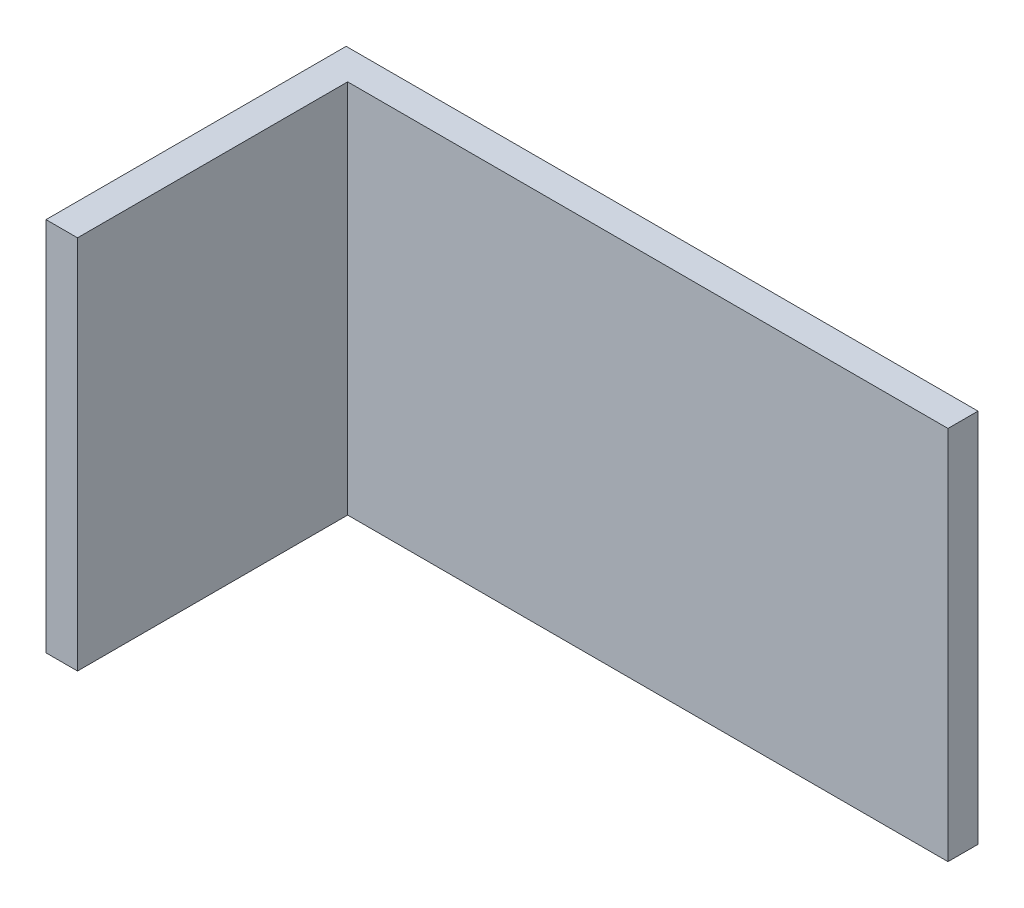
ISO-10303-21;
HEADER;
FILE_DESCRIPTION(('STEP AP214'),'2;1');
FILE_NAME('part.step','',(''),(''),'','','');
FILE_SCHEMA(('AUTOMOTIVE_DESIGN { 1 0 10303 214 1 1 1 1 }'));
ENDSEC;
DATA;
#1=APPLICATION_CONTEXT('core data for automotive mechanical design processes');
#2=APPLICATION_PROTOCOL_DEFINITION('international standard','automotive_design',2000,#1);
#3=PRODUCT_CONTEXT('',#1,'mechanical');
#4=PRODUCT('Part','Part','',(#3));
#5=PRODUCT_RELATED_PRODUCT_CATEGORY('part','',(#4));
#6=PRODUCT_DEFINITION_FORMATION('','',#4);
#7=PRODUCT_DEFINITION_CONTEXT('part definition',#1,'design');
#8=PRODUCT_DEFINITION('design','',#6,#7);
#9=PRODUCT_DEFINITION_SHAPE('','',#8);
#10=(LENGTH_UNIT() NAMED_UNIT(*) SI_UNIT(.MILLI.,.METRE.));
#11=(NAMED_UNIT(*) PLANE_ANGLE_UNIT() SI_UNIT($,.RADIAN.));
#12=(NAMED_UNIT(*) SI_UNIT($,.STERADIAN.) SOLID_ANGLE_UNIT());
#13=UNCERTAINTY_MEASURE_WITH_UNIT(LENGTH_MEASURE(1.E-05),#10,'distance_accuracy_value','');
#14=(GEOMETRIC_REPRESENTATION_CONTEXT(3) GLOBAL_UNCERTAINTY_ASSIGNED_CONTEXT((#13)) GLOBAL_UNIT_ASSIGNED_CONTEXT((#10,
#11,#12)) REPRESENTATION_CONTEXT('',''));
#15=CARTESIAN_POINT('',(0.,0.,0.));
#16=DIRECTION('',(0.,0.,1.));
#17=DIRECTION('',(1.,0.,0.));
#18=AXIS2_PLACEMENT_3D('',#15,#16,#17);
#19=CARTESIAN_POINT('',(-1.53882069959544,-0.25,0.2));
#20=DIRECTION('',(0.,0.,1.));
#21=DIRECTION('',(1.,0.,0.));
#22=AXIS2_PLACEMENT_3D('',#19,#20,#21);
#23=PLANE('',#22);
#24=DIRECTION('',(0.,-1.,0.));
#25=VECTOR('',#24,1.);
#26=CARTESIAN_POINT('',(-1.54932069959544,-0.25,0.2));
#27=LINE('',#26,#25);
#28=CARTESIAN_POINT('',(-1.54932069959544,-0.125,0.2));
#29=VERTEX_POINT('',#28);
#30=CARTESIAN_POINT('',(-1.54932069959544,-0.375,0.2));
#31=VERTEX_POINT('',#30);
#32=EDGE_CURVE('E59',#29,#31,#27,.T.);
#33=ORIENTED_EDGE('',*,*,#32,.T.);
#34=DIRECTION('',(1.,0.,0.));
#35=VECTOR('',#34,1.);
#36=CARTESIAN_POINT('',(-1.39679171408819,-0.375,0.2));
#37=LINE('',#36,#35);
#38=CARTESIAN_POINT('',(-1.52832069959544,-0.375,0.2));
#39=VERTEX_POINT('',#38);
#40=EDGE_CURVE('E106',#31,#39,#37,.T.);
#41=ORIENTED_EDGE('',*,*,#40,.T.);
#42=DIRECTION('',(0.,-1.,0.));
#43=VECTOR('',#42,1.);
#44=CARTESIAN_POINT('',(-1.52832069959544,-0.25,0.2));
#45=LINE('',#44,#43);
#46=CARTESIAN_POINT('',(-1.52832069959544,-0.125,0.2));
#47=VERTEX_POINT('',#46);
#48=EDGE_CURVE('E11',#47,#39,#45,.T.);
#49=ORIENTED_EDGE('',*,*,#48,.F.);
#50=DIRECTION('',(1.,0.,0.));
#51=VECTOR('',#50,1.);
#52=CARTESIAN_POINT('',(-1.39679171408819,-0.125,0.2));
#53=LINE('',#52,#51);
#54=EDGE_CURVE('E154',#29,#47,#53,.T.);
#55=ORIENTED_EDGE('',*,*,#54,.F.);
#56=EDGE_LOOP('',(#33,#41,#49,#55));
#57=FACE_BOUND('',#56,.T.);
#58=ADVANCED_FACE('F17',(#57),#23,.T.);
#59=CARTESIAN_POINT('',(-1.52832069959544,-0.25,0.11));
#60=DIRECTION('',(1.,0.,0.));
#61=DIRECTION('',(0.,0.,1.));
#62=AXIS2_PLACEMENT_3D('',#59,#60,#61);
#63=PLANE('',#62);
#64=DIRECTION('',(0.,0.,-1.));
#65=VECTOR('',#64,1.);
#66=CARTESIAN_POINT('',(-1.52832069959544,-0.125,0.0420289855072459));
#67=LINE('',#66,#65);
#68=CARTESIAN_POINT('',(-1.52832069959544,-0.125,0.02));
#69=VERTEX_POINT('',#68);
#70=EDGE_CURVE('E143',#47,#69,#67,.T.);
#71=ORIENTED_EDGE('',*,*,#70,.F.);
#72=ORIENTED_EDGE('',*,*,#48,.T.);
#73=DIRECTION('',(0.,0.,-1.));
#74=VECTOR('',#73,1.);
#75=CARTESIAN_POINT('',(-1.52832069959544,-0.375,0.0420289855072459));
#76=LINE('',#75,#74);
#77=CARTESIAN_POINT('',(-1.52832069959544,-0.375,0.02));
#78=VERTEX_POINT('',#77);
#79=EDGE_CURVE('E148',#39,#78,#76,.T.);
#80=ORIENTED_EDGE('',*,*,#79,.T.);
#81=DIRECTION('',(0.,-1.,0.));
#82=VECTOR('',#81,1.);
#83=CARTESIAN_POINT('',(-1.52832069959544,-0.25,0.02));
#84=LINE('',#83,#82);
#85=EDGE_CURVE('E25',#69,#78,#84,.T.);
#86=ORIENTED_EDGE('',*,*,#85,.F.);
#87=EDGE_LOOP('',(#71,#72,#80,#86));
#88=FACE_BOUND('',#87,.T.);
#89=ADVANCED_FACE('F311',(#88),#63,.T.);
#90=CARTESIAN_POINT('',(-1.32832069959544,-0.25,0.02));
#91=DIRECTION('',(0.,0.,1.));
#92=DIRECTION('',(1.,0.,0.));
#93=AXIS2_PLACEMENT_3D('',#90,#91,#92);
#94=PLANE('',#93);
#95=DIRECTION('',(1.,0.,0.));
#96=VECTOR('',#95,1.);
#97=CARTESIAN_POINT('',(-1.39679171408819,-0.375,0.02));
#98=LINE('',#97,#96);
#99=CARTESIAN_POINT('',(-1.12832069959544,-0.375,0.02));
#100=VERTEX_POINT('',#99);
#101=EDGE_CURVE('E158',#78,#100,#98,.T.);
#102=ORIENTED_EDGE('',*,*,#101,.T.);
#103=DIRECTION('',(0.,-1.,0.));
#104=VECTOR('',#103,1.);
#105=CARTESIAN_POINT('',(-1.12832069959544,-0.25,0.02));
#106=LINE('',#105,#104);
#107=CARTESIAN_POINT('',(-1.12832069959544,-0.125,0.02));
#108=VERTEX_POINT('',#107);
#109=EDGE_CURVE('E136',#108,#100,#106,.T.);
#110=ORIENTED_EDGE('',*,*,#109,.F.);
#111=DIRECTION('',(1.,0.,0.));
#112=VECTOR('',#111,1.);
#113=CARTESIAN_POINT('',(-1.39679171408819,-0.125,0.02));
#114=LINE('',#113,#112);
#115=EDGE_CURVE('E140',#69,#108,#114,.T.);
#116=ORIENTED_EDGE('',*,*,#115,.F.);
#117=ORIENTED_EDGE('',*,*,#85,.T.);
#118=EDGE_LOOP('',(#102,#110,#116,#117));
#119=FACE_BOUND('',#118,.T.);
#120=ADVANCED_FACE('F315',(#119),#94,.T.);
#121=CARTESIAN_POINT('',(-1.39679171408819,-0.125,0.0420289855072459));
#122=DIRECTION('',(0.,1.,0.));
#123=DIRECTION('',(1.,0.,0.));
#124=AXIS2_PLACEMENT_3D('',#121,#122,#123);
#125=PLANE('',#124);
#126=DIRECTION('',(0.,0.,1.));
#127=VECTOR('',#126,1.);
#128=CARTESIAN_POINT('',(-1.54932069959544,-0.125,0.0999999999999988));
#129=LINE('',#128,#127);
#130=CARTESIAN_POINT('',(-1.54932069959544,-0.125,0.));
#131=VERTEX_POINT('',#130);
#132=EDGE_CURVE('E114',#131,#29,#129,.T.);
#133=ORIENTED_EDGE('',*,*,#132,.T.);
#134=ORIENTED_EDGE('',*,*,#54,.T.);
#135=ORIENTED_EDGE('',*,*,#70,.T.);
#136=ORIENTED_EDGE('',*,*,#115,.T.);
#137=DIRECTION('',(0.,0.,1.));
#138=VECTOR('',#137,1.);
#139=CARTESIAN_POINT('',(-1.12832069959544,-0.125,0.01));
#140=LINE('',#139,#138);
#141=CARTESIAN_POINT('',(-1.12832069959544,-0.125,0.));
#142=VERTEX_POINT('',#141);
#143=EDGE_CURVE('E132',#142,#108,#140,.T.);
#144=ORIENTED_EDGE('',*,*,#143,.F.);
#145=DIRECTION('',(-1.,0.,0.));
#146=VECTOR('',#145,1.);
#147=CARTESIAN_POINT('',(-1.33882069959543,-0.125,0.));
#148=LINE('',#147,#146);
#149=EDGE_CURVE('E119',#142,#131,#148,.T.);
#150=ORIENTED_EDGE('',*,*,#149,.T.);
#151=EDGE_LOOP('',(#133,#134,#135,#136,#144,#150));
#152=FACE_BOUND('',#151,.T.);
#153=ADVANCED_FACE('F303',(#152),#125,.T.);
#154=CARTESIAN_POINT('',(-1.54932069959544,-0.25,0.0999999999999988));
#155=DIRECTION('',(1.,0.,0.));
#156=DIRECTION('',(0.,0.,1.));
#157=AXIS2_PLACEMENT_3D('',#154,#155,#156);
#158=PLANE('',#157);
#159=DIRECTION('',(0.,-1.,0.));
#160=VECTOR('',#159,1.);
#161=CARTESIAN_POINT('',(-1.54932069959544,-0.25,0.));
#162=LINE('',#161,#160);
#163=CARTESIAN_POINT('',(-1.54932069959544,-0.375,0.));
#164=VERTEX_POINT('',#163);
#165=EDGE_CURVE('E111',#131,#164,#162,.T.);
#166=ORIENTED_EDGE('',*,*,#165,.T.);
#167=DIRECTION('',(0.,0.,1.));
#168=VECTOR('',#167,1.);
#169=CARTESIAN_POINT('',(-1.54932069959544,-0.375,0.0420289855072459));
#170=LINE('',#169,#168);
#171=EDGE_CURVE('E98',#164,#31,#170,.T.);
#172=ORIENTED_EDGE('',*,*,#171,.T.);
#173=ORIENTED_EDGE('',*,*,#32,.F.);
#174=ORIENTED_EDGE('',*,*,#132,.F.);
#175=EDGE_LOOP('',(#166,#172,#173,#174));
#176=FACE_BOUND('',#175,.T.);
#177=ADVANCED_FACE('F112',(#176),#158,.F.);
#178=CARTESIAN_POINT('',(-1.39679171408819,-0.375,0.0420289855072459));
#179=DIRECTION('',(0.,1.,0.));
#180=DIRECTION('',(0.,0.,-1.));
#181=AXIS2_PLACEMENT_3D('',#178,#179,#180);
#182=PLANE('',#181);
#183=ORIENTED_EDGE('',*,*,#101,.F.);
#184=ORIENTED_EDGE('',*,*,#79,.F.);
#185=ORIENTED_EDGE('',*,*,#40,.F.);
#186=ORIENTED_EDGE('',*,*,#171,.F.);
#187=DIRECTION('',(1.,0.,0.));
#188=VECTOR('',#187,1.);
#189=CARTESIAN_POINT('',(-1.33882069959543,-0.375,0.));
#190=LINE('',#189,#188);
#191=CARTESIAN_POINT('',(-1.12832069959544,-0.375,0.));
#192=VERTEX_POINT('',#191);
#193=EDGE_CURVE('E104',#164,#192,#190,.T.);
#194=ORIENTED_EDGE('',*,*,#193,.T.);
#195=DIRECTION('',(0.,0.,-1.));
#196=VECTOR('',#195,1.);
#197=CARTESIAN_POINT('',(-1.12832069959544,-0.375,0.01));
#198=LINE('',#197,#196);
#199=EDGE_CURVE('E137',#100,#192,#198,.T.);
#200=ORIENTED_EDGE('',*,*,#199,.F.);
#201=EDGE_LOOP('',(#183,#184,#185,#186,#194,#200));
#202=FACE_BOUND('',#201,.T.);
#203=ADVANCED_FACE('F101',(#202),#182,.F.);
#204=CARTESIAN_POINT('',(-1.12832069959544,-0.25,0.01));
#205=DIRECTION('',(1.,0.,0.));
#206=DIRECTION('',(0.,0.,-1.));
#207=AXIS2_PLACEMENT_3D('',#204,#205,#206);
#208=PLANE('',#207);
#209=ORIENTED_EDGE('',*,*,#199,.T.);
#210=DIRECTION('',(0.,1.,0.));
#211=VECTOR('',#210,1.);
#212=CARTESIAN_POINT('',(-1.12832069959544,-0.25,0.));
#213=LINE('',#212,#211);
#214=EDGE_CURVE('E124',#192,#142,#213,.T.);
#215=ORIENTED_EDGE('',*,*,#214,.T.);
#216=ORIENTED_EDGE('',*,*,#143,.T.);
#217=ORIENTED_EDGE('',*,*,#109,.T.);
#218=EDGE_LOOP('',(#209,#215,#216,#217));
#219=FACE_BOUND('',#218,.T.);
#220=ADVANCED_FACE('F270',(#219),#208,.T.);
#221=CARTESIAN_POINT('',(-1.33882069959543,-0.25,0.));
#222=DIRECTION('',(0.,0.,1.));
#223=DIRECTION('',(1.,0.,0.));
#224=AXIS2_PLACEMENT_3D('',#221,#222,#223);
#225=PLANE('',#224);
#226=ORIENTED_EDGE('',*,*,#193,.F.);
#227=ORIENTED_EDGE('',*,*,#165,.F.);
#228=ORIENTED_EDGE('',*,*,#149,.F.);
#229=ORIENTED_EDGE('',*,*,#214,.F.);
#230=EDGE_LOOP('',(#226,#227,#228,#229));
#231=FACE_BOUND('',#230,.T.);
#232=ADVANCED_FACE('F122',(#231),#225,.F.);
#233=CLOSED_SHELL('',(#58,#89,#120,#153,#177,#203,#220,#232));
#234=MANIFOLD_SOLID_BREP('B1',#233);
#235=ADVANCED_BREP_SHAPE_REPRESENTATION('',(#18,#234),#14);
#236=SHAPE_DEFINITION_REPRESENTATION(#9,#235);
ENDSEC;
END-ISO-10303-21;
